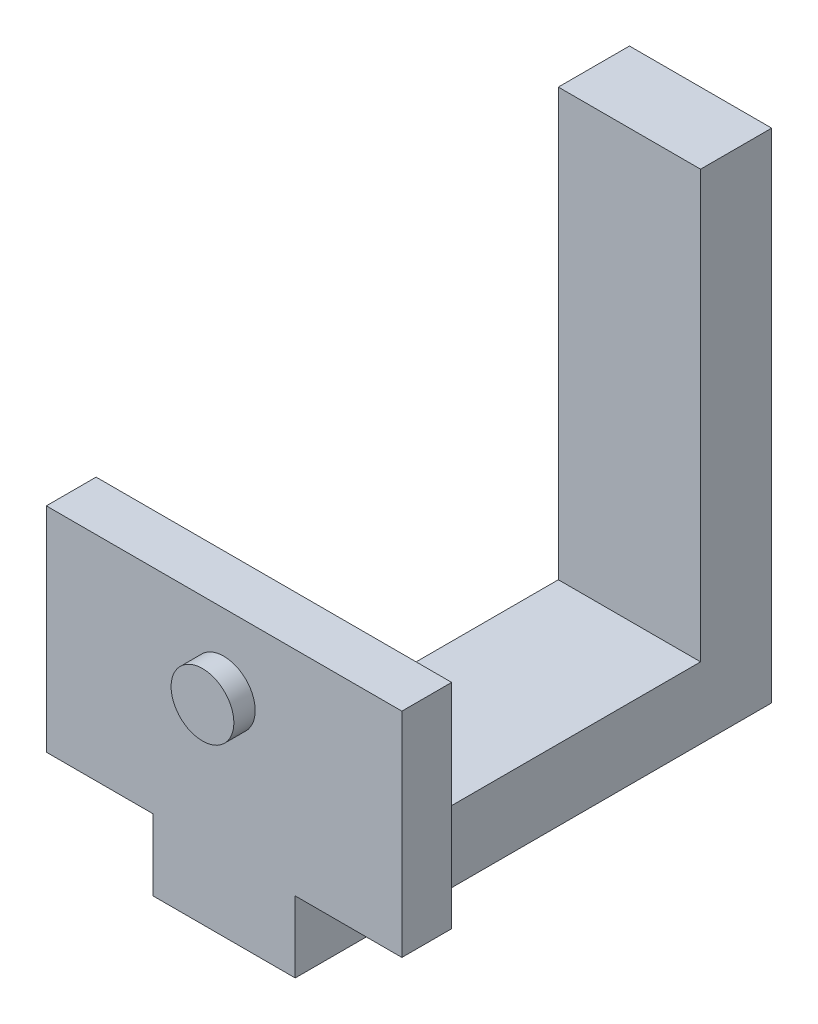
ISO-10303-21;
HEADER;
FILE_DESCRIPTION(('STEP AP214'),'2;1');
FILE_NAME('part.step','',(''),(''),'','','');
FILE_SCHEMA(('AUTOMOTIVE_DESIGN { 1 0 10303 214 1 1 1 1 }'));
ENDSEC;
DATA;
#1=APPLICATION_CONTEXT('core data for automotive mechanical design processes');
#2=APPLICATION_PROTOCOL_DEFINITION('international standard','automotive_design',2000,#1);
#3=PRODUCT_CONTEXT('',#1,'mechanical');
#4=PRODUCT('Part','Part','',(#3));
#5=PRODUCT_RELATED_PRODUCT_CATEGORY('part','',(#4));
#6=PRODUCT_DEFINITION_FORMATION('','',#4);
#7=PRODUCT_DEFINITION_CONTEXT('part definition',#1,'design');
#8=PRODUCT_DEFINITION('design','',#6,#7);
#9=PRODUCT_DEFINITION_SHAPE('','',#8);
#10=(LENGTH_UNIT() NAMED_UNIT(*) SI_UNIT(.MILLI.,.METRE.));
#11=(NAMED_UNIT(*) PLANE_ANGLE_UNIT() SI_UNIT($,.RADIAN.));
#12=(NAMED_UNIT(*) SI_UNIT($,.STERADIAN.) SOLID_ANGLE_UNIT());
#13=UNCERTAINTY_MEASURE_WITH_UNIT(LENGTH_MEASURE(1.E-05),#10,'distance_accuracy_value','');
#14=(GEOMETRIC_REPRESENTATION_CONTEXT(3) GLOBAL_UNCERTAINTY_ASSIGNED_CONTEXT((#13)) GLOBAL_UNIT_ASSIGNED_CONTEXT((#10,
#11,#12)) REPRESENTATION_CONTEXT('',''));
#15=CARTESIAN_POINT('',(0.,0.,0.));
#16=DIRECTION('',(0.,0.,1.));
#17=DIRECTION('',(1.,0.,0.));
#18=AXIS2_PLACEMENT_3D('',#15,#16,#17);
#19=CARTESIAN_POINT('',(0.,0.,10.));
#20=DIRECTION('',(0.,0.,-1.));
#21=DIRECTION('',(-1.,0.,0.));
#22=AXIS2_PLACEMENT_3D('',#19,#20,#21);
#23=PLANE('',#22);
#24=DIRECTION('',(-1.,0.,0.));
#25=VECTOR('',#24,1.);
#26=CARTESIAN_POINT('',(0.,10.,10.));
#27=LINE('',#26,#25);
#28=CARTESIAN_POINT('',(20.,10.,10.));
#29=VERTEX_POINT('',#28);
#30=CARTESIAN_POINT('',(0.,10.,10.));
#31=VERTEX_POINT('',#30);
#32=EDGE_CURVE('E156',#29,#31,#27,.T.);
#33=ORIENTED_EDGE('',*,*,#32,.F.);
#34=DIRECTION('',(0.,1.,0.));
#35=VECTOR('',#34,1.);
#36=CARTESIAN_POINT('',(20.,0.,10.));
#37=LINE('',#36,#35);
#38=CARTESIAN_POINT('',(20.,70.,10.));
#39=VERTEX_POINT('',#38);
#40=EDGE_CURVE('E160',#29,#39,#37,.T.);
#41=ORIENTED_EDGE('',*,*,#40,.T.);
#42=DIRECTION('',(-1.,0.,0.));
#43=VECTOR('',#42,1.);
#44=CARTESIAN_POINT('',(0.,70.,10.));
#45=LINE('',#44,#43);
#46=CARTESIAN_POINT('',(0.,70.,10.));
#47=VERTEX_POINT('',#46);
#48=EDGE_CURVE('E66',#39,#47,#45,.T.);
#49=ORIENTED_EDGE('',*,*,#48,.T.);
#50=DIRECTION('',(0.,-1.,0.));
#51=VECTOR('',#50,1.);
#52=CARTESIAN_POINT('',(0.,0.,10.));
#53=LINE('',#52,#51);
#54=EDGE_CURVE('E96',#47,#31,#53,.T.);
#55=ORIENTED_EDGE('',*,*,#54,.T.);
#56=EDGE_LOOP('',(#33,#41,#49,#55));
#57=FACE_BOUND('',#56,.T.);
#58=ADVANCED_FACE('F41',(#57),#23,.F.);
#59=CARTESIAN_POINT('',(0.,0.,10.));
#60=DIRECTION('',(1.,0.,0.));
#61=DIRECTION('',(0.,0.,-1.));
#62=AXIS2_PLACEMENT_3D('',#59,#60,#61);
#63=PLANE('',#62);
#64=DIRECTION('',(0.,-1.,0.));
#65=VECTOR('',#64,1.);
#66=CARTESIAN_POINT('',(0.,0.,0.));
#67=LINE('',#66,#65);
#68=CARTESIAN_POINT('',(0.,70.,0.));
#69=VERTEX_POINT('',#68);
#70=CARTESIAN_POINT('',(0.,0.,0.));
#71=VERTEX_POINT('',#70);
#72=EDGE_CURVE('E102',#69,#71,#67,.T.);
#73=ORIENTED_EDGE('',*,*,#72,.T.);
#74=DIRECTION('',(0.,0.,-1.));
#75=VECTOR('',#74,1.);
#76=CARTESIAN_POINT('',(0.,0.,10.));
#77=LINE('',#76,#75);
#78=CARTESIAN_POINT('',(0.,0.,67.));
#79=VERTEX_POINT('',#78);
#80=EDGE_CURVE('E50',#79,#71,#77,.T.);
#81=ORIENTED_EDGE('',*,*,#80,.F.);
#82=DIRECTION('',(0.,-1.,0.));
#83=VECTOR('',#82,1.);
#84=CARTESIAN_POINT('',(0.,0.,67.));
#85=LINE('',#84,#83);
#86=CARTESIAN_POINT('',(0.,10.,67.));
#87=VERTEX_POINT('',#86);
#88=EDGE_CURVE('E139',#87,#79,#85,.T.);
#89=ORIENTED_EDGE('',*,*,#88,.F.);
#90=DIRECTION('',(0.,0.,-1.));
#91=VECTOR('',#90,1.);
#92=CARTESIAN_POINT('',(0.,10.,60.));
#93=LINE('',#92,#91);
#94=CARTESIAN_POINT('',(0.,10.,60.));
#95=VERTEX_POINT('',#94);
#96=EDGE_CURVE('E154',#87,#95,#93,.T.);
#97=ORIENTED_EDGE('',*,*,#96,.T.);
#98=EDGE_CURVE('E151',#95,#31,#93,.T.);
#99=ORIENTED_EDGE('',*,*,#98,.T.);
#100=ORIENTED_EDGE('',*,*,#54,.F.);
#101=DIRECTION('',(0.,0.,-1.));
#102=VECTOR('',#101,1.);
#103=CARTESIAN_POINT('',(0.,70.,10.));
#104=LINE('',#103,#102);
#105=EDGE_CURVE('E88',#47,#69,#104,.T.);
#106=ORIENTED_EDGE('',*,*,#105,.T.);
#107=EDGE_LOOP('',(#73,#81,#89,#97,#99,#100,#106));
#108=FACE_BOUND('',#107,.T.);
#109=ADVANCED_FACE('F43',(#108),#63,.F.);
#110=CARTESIAN_POINT('',(0.,0.,10.));
#111=DIRECTION('',(0.,1.,0.));
#112=DIRECTION('',(0.,0.,1.));
#113=AXIS2_PLACEMENT_3D('',#110,#111,#112);
#114=PLANE('',#113);
#115=DIRECTION('',(1.,0.,0.));
#116=VECTOR('',#115,1.);
#117=CARTESIAN_POINT('',(0.,0.,0.));
#118=LINE('',#117,#116);
#119=CARTESIAN_POINT('',(20.,0.,0.));
#120=VERTEX_POINT('',#119);
#121=EDGE_CURVE('E107',#71,#120,#118,.T.);
#122=ORIENTED_EDGE('',*,*,#121,.T.);
#123=DIRECTION('',(0.,0.,-1.));
#124=VECTOR('',#123,1.);
#125=CARTESIAN_POINT('',(20.,0.,10.));
#126=LINE('',#125,#124);
#127=CARTESIAN_POINT('',(20.,0.,67.));
#128=VERTEX_POINT('',#127);
#129=EDGE_CURVE('E124',#128,#120,#126,.T.);
#130=ORIENTED_EDGE('',*,*,#129,.F.);
#131=DIRECTION('',(1.,0.,0.));
#132=VECTOR('',#131,1.);
#133=CARTESIAN_POINT('',(0.,0.,67.));
#134=LINE('',#133,#132);
#135=EDGE_CURVE('E134',#79,#128,#134,.T.);
#136=ORIENTED_EDGE('',*,*,#135,.F.);
#137=ORIENTED_EDGE('',*,*,#80,.T.);
#138=EDGE_LOOP('',(#122,#130,#136,#137));
#139=FACE_BOUND('',#138,.T.);
#140=ADVANCED_FACE('F130',(#139),#114,.F.);
#141=CARTESIAN_POINT('',(20.,0.,10.));
#142=DIRECTION('',(-1.,0.,0.));
#143=DIRECTION('',(0.,0.,1.));
#144=AXIS2_PLACEMENT_3D('',#141,#142,#143);
#145=PLANE('',#144);
#146=DIRECTION('',(0.,1.,0.));
#147=VECTOR('',#146,1.);
#148=CARTESIAN_POINT('',(20.,0.,0.));
#149=LINE('',#148,#147);
#150=CARTESIAN_POINT('',(20.,70.,0.));
#151=VERTEX_POINT('',#150);
#152=EDGE_CURVE('E97',#120,#151,#149,.T.);
#153=ORIENTED_EDGE('',*,*,#152,.T.);
#154=DIRECTION('',(0.,0.,-1.));
#155=VECTOR('',#154,1.);
#156=CARTESIAN_POINT('',(20.,70.,10.));
#157=LINE('',#156,#155);
#158=EDGE_CURVE('E91',#39,#151,#157,.T.);
#159=ORIENTED_EDGE('',*,*,#158,.F.);
#160=ORIENTED_EDGE('',*,*,#40,.F.);
#161=DIRECTION('',(0.,0.,-1.));
#162=VECTOR('',#161,1.);
#163=CARTESIAN_POINT('',(20.,10.,60.));
#164=LINE('',#163,#162);
#165=CARTESIAN_POINT('',(20.,10.,60.));
#166=VERTEX_POINT('',#165);
#167=EDGE_CURVE('E57',#166,#29,#164,.T.);
#168=ORIENTED_EDGE('',*,*,#167,.F.);
#169=CARTESIAN_POINT('',(20.,10.,67.));
#170=VERTEX_POINT('',#169);
#171=EDGE_CURVE('E110',#170,#166,#164,.T.);
#172=ORIENTED_EDGE('',*,*,#171,.F.);
#173=DIRECTION('',(0.,1.,0.));
#174=VECTOR('',#173,1.);
#175=CARTESIAN_POINT('',(20.,0.,67.));
#176=LINE('',#175,#174);
#177=EDGE_CURVE('E164',#128,#170,#176,.T.);
#178=ORIENTED_EDGE('',*,*,#177,.F.);
#179=ORIENTED_EDGE('',*,*,#129,.T.);
#180=EDGE_LOOP('',(#153,#159,#160,#168,#172,#178,#179));
#181=FACE_BOUND('',#180,.T.);
#182=ADVANCED_FACE('F174',(#181),#145,.F.);
#183=CARTESIAN_POINT('',(0.,70.,10.));
#184=DIRECTION('',(0.,-1.,0.));
#185=DIRECTION('',(0.,0.,-1.));
#186=AXIS2_PLACEMENT_3D('',#183,#184,#185);
#187=PLANE('',#186);
#188=DIRECTION('',(-1.,0.,0.));
#189=VECTOR('',#188,1.);
#190=CARTESIAN_POINT('',(0.,70.,0.));
#191=LINE('',#190,#189);
#192=EDGE_CURVE('E85',#151,#69,#191,.T.);
#193=ORIENTED_EDGE('',*,*,#192,.T.);
#194=ORIENTED_EDGE('',*,*,#105,.F.);
#195=ORIENTED_EDGE('',*,*,#48,.F.);
#196=ORIENTED_EDGE('',*,*,#158,.T.);
#197=EDGE_LOOP('',(#193,#194,#195,#196));
#198=FACE_BOUND('',#197,.T.);
#199=ADVANCED_FACE('F87',(#198),#187,.F.);
#200=CARTESIAN_POINT('',(0.,0.,0.));
#201=DIRECTION('',(0.,0.,-1.));
#202=DIRECTION('',(-1.,0.,0.));
#203=AXIS2_PLACEMENT_3D('',#200,#201,#202);
#204=PLANE('',#203);
#205=ORIENTED_EDGE('',*,*,#72,.F.);
#206=ORIENTED_EDGE('',*,*,#192,.F.);
#207=ORIENTED_EDGE('',*,*,#152,.F.);
#208=ORIENTED_EDGE('',*,*,#121,.F.);
#209=EDGE_LOOP('',(#205,#206,#207,#208));
#210=FACE_BOUND('',#209,.T.);
#211=ADVANCED_FACE('F106',(#210),#204,.T.);
#212=CARTESIAN_POINT('',(0.,10.,60.));
#213=DIRECTION('',(0.,-1.,0.));
#214=DIRECTION('',(0.,0.,-1.));
#215=AXIS2_PLACEMENT_3D('',#212,#213,#214);
#216=PLANE('',#215);
#217=ORIENTED_EDGE('',*,*,#98,.F.);
#218=DIRECTION('',(1.,0.,0.));
#219=VECTOR('',#218,1.);
#220=CARTESIAN_POINT('',(0.,10.,60.));
#221=LINE('',#220,#219);
#222=EDGE_CURVE('E218',#95,#166,#221,.T.);
#223=ORIENTED_EDGE('',*,*,#222,.T.);
#224=ORIENTED_EDGE('',*,*,#167,.T.);
#225=ORIENTED_EDGE('',*,*,#32,.T.);
#226=EDGE_LOOP('',(#217,#223,#224,#225));
#227=FACE_BOUND('',#226,.T.);
#228=ADVANCED_FACE('F162',(#227),#216,.F.);
#229=CARTESIAN_POINT('',(0.,0.,67.));
#230=DIRECTION('',(0.,0.,-1.));
#231=DIRECTION('',(-1.,0.,0.));
#232=AXIS2_PLACEMENT_3D('',#229,#230,#231);
#233=PLANE('',#232);
#234=CARTESIAN_POINT('',(9.95768160561283,29.7548541325412,67.));
#235=DIRECTION('',(0.,0.,-1.));
#236=DIRECTION('',(-1.,0.,0.));
#237=AXIS2_PLACEMENT_3D('',#234,#235,#236);
#238=CIRCLE('',#237,4.4144640547634);
#239=CARTESIAN_POINT('',(5.54321755084943,29.7548541325412,67.));
#240=VERTEX_POINT('',#239);
#241=EDGE_CURVE('E11',#240,#240,#238,.F.);
#242=ORIENTED_EDGE('',*,*,#241,.F.);
#243=EDGE_LOOP('',(#242));
#244=FACE_BOUND('',#243,.T.);
#245=ORIENTED_EDGE('',*,*,#88,.T.);
#246=ORIENTED_EDGE('',*,*,#135,.T.);
#247=ORIENTED_EDGE('',*,*,#177,.T.);
#248=DIRECTION('',(-1.,0.,0.));
#249=VECTOR('',#248,1.);
#250=CARTESIAN_POINT('',(0.,10.,67.));
#251=LINE('',#250,#249);
#252=CARTESIAN_POINT('',(35.,10.,67.));
#253=VERTEX_POINT('',#252);
#254=EDGE_CURVE('E206',#253,#170,#251,.T.);
#255=ORIENTED_EDGE('',*,*,#254,.F.);
#256=DIRECTION('',(0.,-1.,0.));
#257=VECTOR('',#256,1.);
#258=CARTESIAN_POINT('',(35.,40.,67.));
#259=LINE('',#258,#257);
#260=CARTESIAN_POINT('',(35.,40.,67.));
#261=VERTEX_POINT('',#260);
#262=EDGE_CURVE('E192',#261,#253,#259,.T.);
#263=ORIENTED_EDGE('',*,*,#262,.F.);
#264=DIRECTION('',(-1.,0.,0.));
#265=VECTOR('',#264,1.);
#266=CARTESIAN_POINT('',(0.,40.,67.));
#267=LINE('',#266,#265);
#268=CARTESIAN_POINT('',(-15.,40.,67.));
#269=VERTEX_POINT('',#268);
#270=EDGE_CURVE('E223',#261,#269,#267,.T.);
#271=ORIENTED_EDGE('',*,*,#270,.T.);
#272=DIRECTION('',(0.,-1.,0.));
#273=VECTOR('',#272,1.);
#274=CARTESIAN_POINT('',(-15.,40.,67.));
#275=LINE('',#274,#273);
#276=CARTESIAN_POINT('',(-15.,10.,67.));
#277=VERTEX_POINT('',#276);
#278=EDGE_CURVE('E188',#269,#277,#275,.T.);
#279=ORIENTED_EDGE('',*,*,#278,.T.);
#280=EDGE_CURVE('E209',#87,#277,#251,.T.);
#281=ORIENTED_EDGE('',*,*,#280,.F.);
#282=EDGE_LOOP('',(#245,#246,#247,#255,#263,#271,#279,#281));
#283=FACE_BOUND('',#282,.T.);
#284=ADVANCED_FACE('F178',(#244,#283),#233,.F.);
#285=CARTESIAN_POINT('',(0.,10.,0.));
#286=DIRECTION('',(0.,1.,0.));
#287=DIRECTION('',(0.,0.,1.));
#288=AXIS2_PLACEMENT_3D('',#285,#286,#287);
#289=PLANE('',#288);
#290=CARTESIAN_POINT('',(-15.,10.,60.));
#291=VERTEX_POINT('',#290);
#292=EDGE_CURVE('E214',#291,#95,#221,.T.);
#293=ORIENTED_EDGE('',*,*,#292,.T.);
#294=ORIENTED_EDGE('',*,*,#96,.F.);
#295=ORIENTED_EDGE('',*,*,#280,.T.);
#296=DIRECTION('',(0.,0.,-1.));
#297=VECTOR('',#296,1.);
#298=CARTESIAN_POINT('',(-15.,10.,0.));
#299=LINE('',#298,#297);
#300=EDGE_CURVE('E210',#277,#291,#299,.T.);
#301=ORIENTED_EDGE('',*,*,#300,.T.);
#302=EDGE_LOOP('',(#293,#294,#295,#301));
#303=FACE_BOUND('',#302,.T.);
#304=ADVANCED_FACE('F281',(#303),#289,.F.);
#305=ORIENTED_EDGE('',*,*,#254,.T.);
#306=ORIENTED_EDGE('',*,*,#171,.T.);
#307=CARTESIAN_POINT('',(35.,10.,60.));
#308=VERTEX_POINT('',#307);
#309=EDGE_CURVE('E219',#166,#308,#221,.T.);
#310=ORIENTED_EDGE('',*,*,#309,.T.);
#311=DIRECTION('',(0.,0.,1.));
#312=VECTOR('',#311,1.);
#313=CARTESIAN_POINT('',(35.,10.,0.));
#314=LINE('',#313,#312);
#315=EDGE_CURVE('E201',#308,#253,#314,.T.);
#316=ORIENTED_EDGE('',*,*,#315,.T.);
#317=EDGE_LOOP('',(#305,#306,#310,#316));
#318=FACE_BOUND('',#317,.T.);
#319=ADVANCED_FACE('F249',(#318),#289,.F.);
#320=CARTESIAN_POINT('',(0.,40.,60.));
#321=DIRECTION('',(0.,0.,-1.));
#322=DIRECTION('',(-1.,0.,0.));
#323=AXIS2_PLACEMENT_3D('',#320,#321,#322);
#324=PLANE('',#323);
#325=ORIENTED_EDGE('',*,*,#292,.F.);
#326=DIRECTION('',(0.,-1.,0.));
#327=VECTOR('',#326,1.);
#328=CARTESIAN_POINT('',(-15.,40.,60.));
#329=LINE('',#328,#327);
#330=CARTESIAN_POINT('',(-15.,40.,60.));
#331=VERTEX_POINT('',#330);
#332=EDGE_CURVE('E182',#331,#291,#329,.T.);
#333=ORIENTED_EDGE('',*,*,#332,.F.);
#334=DIRECTION('',(1.,0.,0.));
#335=VECTOR('',#334,1.);
#336=CARTESIAN_POINT('',(0.,40.,60.));
#337=LINE('',#336,#335);
#338=CARTESIAN_POINT('',(35.,40.,60.));
#339=VERTEX_POINT('',#338);
#340=EDGE_CURVE('E205',#331,#339,#337,.T.);
#341=ORIENTED_EDGE('',*,*,#340,.T.);
#342=DIRECTION('',(0.,-1.,0.));
#343=VECTOR('',#342,1.);
#344=CARTESIAN_POINT('',(35.,40.,60.));
#345=LINE('',#344,#343);
#346=EDGE_CURVE('E196',#339,#308,#345,.T.);
#347=ORIENTED_EDGE('',*,*,#346,.T.);
#348=ORIENTED_EDGE('',*,*,#309,.F.);
#349=ORIENTED_EDGE('',*,*,#222,.F.);
#350=EDGE_LOOP('',(#325,#333,#341,#347,#348,#349));
#351=FACE_BOUND('',#350,.T.);
#352=ADVANCED_FACE('F250',(#351),#324,.T.);
#353=CARTESIAN_POINT('',(-15.,40.,0.));
#354=DIRECTION('',(-1.,0.,0.));
#355=DIRECTION('',(0.,0.,1.));
#356=AXIS2_PLACEMENT_3D('',#353,#354,#355);
#357=PLANE('',#356);
#358=ORIENTED_EDGE('',*,*,#300,.F.);
#359=ORIENTED_EDGE('',*,*,#278,.F.);
#360=DIRECTION('',(0.,0.,-1.));
#361=VECTOR('',#360,1.);
#362=CARTESIAN_POINT('',(-15.,40.,0.));
#363=LINE('',#362,#361);
#364=EDGE_CURVE('E227',#269,#331,#363,.T.);
#365=ORIENTED_EDGE('',*,*,#364,.T.);
#366=ORIENTED_EDGE('',*,*,#332,.T.);
#367=EDGE_LOOP('',(#358,#359,#365,#366));
#368=FACE_BOUND('',#367,.T.);
#369=ADVANCED_FACE('F277',(#368),#357,.T.);
#370=CARTESIAN_POINT('',(35.,40.,0.));
#371=DIRECTION('',(1.,0.,0.));
#372=DIRECTION('',(0.,0.,-1.));
#373=AXIS2_PLACEMENT_3D('',#370,#371,#372);
#374=PLANE('',#373);
#375=ORIENTED_EDGE('',*,*,#315,.F.);
#376=ORIENTED_EDGE('',*,*,#346,.F.);
#377=DIRECTION('',(0.,0.,1.));
#378=VECTOR('',#377,1.);
#379=CARTESIAN_POINT('',(35.,40.,0.));
#380=LINE('',#379,#378);
#381=EDGE_CURVE('E200',#339,#261,#380,.T.);
#382=ORIENTED_EDGE('',*,*,#381,.T.);
#383=ORIENTED_EDGE('',*,*,#262,.T.);
#384=EDGE_LOOP('',(#375,#376,#382,#383));
#385=FACE_BOUND('',#384,.T.);
#386=ADVANCED_FACE('F261',(#385),#374,.T.);
#387=CARTESIAN_POINT('',(0.,40.,0.));
#388=DIRECTION('',(0.,1.,0.));
#389=DIRECTION('',(0.,0.,1.));
#390=AXIS2_PLACEMENT_3D('',#387,#388,#389);
#391=PLANE('',#390);
#392=ORIENTED_EDGE('',*,*,#340,.F.);
#393=ORIENTED_EDGE('',*,*,#364,.F.);
#394=ORIENTED_EDGE('',*,*,#270,.F.);
#395=ORIENTED_EDGE('',*,*,#381,.F.);
#396=EDGE_LOOP('',(#392,#393,#394,#395));
#397=FACE_BOUND('',#396,.T.);
#398=ADVANCED_FACE('F285',(#397),#391,.T.);
#399=CARTESIAN_POINT('',(9.95768160561283,29.7548541325412,70.));
#400=DIRECTION('',(0.,0.,-1.));
#401=DIRECTION('',(-1.,0.,0.));
#402=AXIS2_PLACEMENT_3D('',#399,#400,#401);
#403=CYLINDRICAL_SURFACE('',#402,4.4144640547634);
#404=CARTESIAN_POINT('',(9.95768160561283,29.7548541325412,70.));
#405=DIRECTION('',(0.,0.,1.));
#406=DIRECTION('',(1.,0.,0.));
#407=AXIS2_PLACEMENT_3D('',#404,#405,#406);
#408=CIRCLE('',#407,4.4144640547634);
#409=CARTESIAN_POINT('',(14.3721456603762,29.7548541325412,70.));
#410=VERTEX_POINT('',#409);
#411=EDGE_CURVE('E234',#410,#410,#408,.T.);
#412=ORIENTED_EDGE('',*,*,#411,.F.);
#413=EDGE_LOOP('',(#412));
#414=FACE_BOUND('',#413,.T.);
#415=ORIENTED_EDGE('',*,*,#241,.T.);
#416=EDGE_LOOP('',(#415));
#417=FACE_BOUND('',#416,.T.);
#418=ADVANCED_FACE('F288',(#414,#417),#403,.T.);
#419=CARTESIAN_POINT('',(9.95768160561283,29.7548541325412,70.));
#420=DIRECTION('',(0.,0.,1.));
#421=DIRECTION('',(1.,0.,0.));
#422=AXIS2_PLACEMENT_3D('',#419,#420,#421);
#423=PLANE('',#422);
#424=ORIENTED_EDGE('',*,*,#411,.T.);
#425=EDGE_LOOP('',(#424));
#426=FACE_BOUND('',#425,.T.);
#427=ADVANCED_FACE('F294',(#426),#423,.T.);
#428=CLOSED_SHELL('',(#58,#109,#140,#182,#199,#211,#228,#284,#304,#319,#352,#369,#386,#398,#418,#427));
#429=MANIFOLD_SOLID_BREP('B2',#428);
#430=ADVANCED_BREP_SHAPE_REPRESENTATION('',(#18,#429),#14);
#431=SHAPE_DEFINITION_REPRESENTATION(#9,#430);
ENDSEC;
END-ISO-10303-21;
